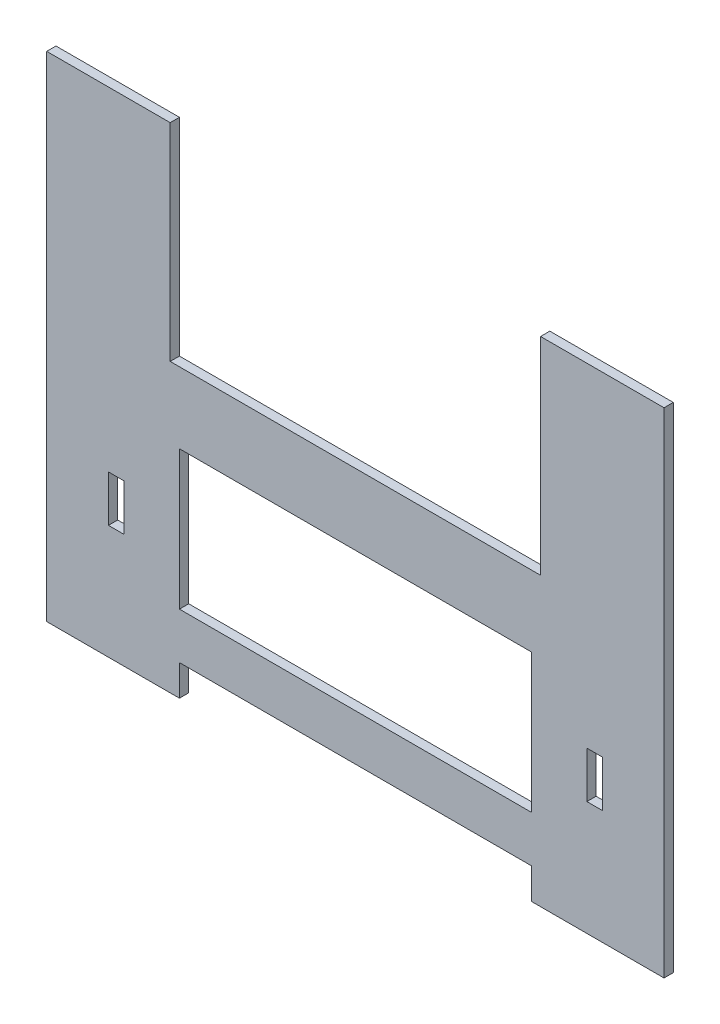
ISO-10303-21;
HEADER;
FILE_DESCRIPTION(('STEP AP214'),'2;1');
FILE_NAME('part.step','',(''),(''),'','','');
FILE_SCHEMA(('AUTOMOTIVE_DESIGN { 1 0 10303 214 1 1 1 1 }'));
ENDSEC;
DATA;
#1=APPLICATION_CONTEXT('core data for automotive mechanical design processes');
#2=APPLICATION_PROTOCOL_DEFINITION('international standard','automotive_design',2000,#1);
#3=PRODUCT_CONTEXT('',#1,'mechanical');
#4=PRODUCT('Part','Part','',(#3));
#5=PRODUCT_RELATED_PRODUCT_CATEGORY('part','',(#4));
#6=PRODUCT_DEFINITION_FORMATION('','',#4);
#7=PRODUCT_DEFINITION_CONTEXT('part definition',#1,'design');
#8=PRODUCT_DEFINITION('design','',#6,#7);
#9=PRODUCT_DEFINITION_SHAPE('','',#8);
#10=(LENGTH_UNIT() NAMED_UNIT(*) SI_UNIT(.MILLI.,.METRE.));
#11=(NAMED_UNIT(*) PLANE_ANGLE_UNIT() SI_UNIT($,.RADIAN.));
#12=(NAMED_UNIT(*) SI_UNIT($,.STERADIAN.) SOLID_ANGLE_UNIT());
#13=UNCERTAINTY_MEASURE_WITH_UNIT(LENGTH_MEASURE(1.E-05),#10,'distance_accuracy_value','');
#14=(GEOMETRIC_REPRESENTATION_CONTEXT(3) GLOBAL_UNCERTAINTY_ASSIGNED_CONTEXT((#13)) GLOBAL_UNIT_ASSIGNED_CONTEXT((#10,
#11,#12)) REPRESENTATION_CONTEXT('',''));
#15=CARTESIAN_POINT('',(0.,0.,0.));
#16=DIRECTION('',(0.,0.,1.));
#17=DIRECTION('',(1.,0.,0.));
#18=AXIS2_PLACEMENT_3D('',#15,#16,#17);
#19=CARTESIAN_POINT('',(0.,0.,3.));
#20=DIRECTION('',(0.,0.,-1.));
#21=DIRECTION('',(-1.,0.,0.));
#22=AXIS2_PLACEMENT_3D('',#19,#20,#21);
#23=PLANE('',#22);
#24=DIRECTION('',(1.,0.,0.));
#25=VECTOR('',#24,1.);
#26=CARTESIAN_POINT('',(-80.,-56.,3.));
#27=LINE('',#26,#25);
#28=CARTESIAN_POINT('',(-80.,-56.,3.));
#29=VERTEX_POINT('',#28);
#30=CARTESIAN_POINT('',(-75.,-56.,3.));
#31=VERTEX_POINT('',#30);
#32=EDGE_CURVE('E212',#29,#31,#27,.T.);
#33=ORIENTED_EDGE('',*,*,#32,.F.);
#34=DIRECTION('',(0.,-1.,0.));
#35=VECTOR('',#34,1.);
#36=CARTESIAN_POINT('',(-80.,-41.,3.));
#37=LINE('',#36,#35);
#38=CARTESIAN_POINT('',(-80.,-41.,3.));
#39=VERTEX_POINT('',#38);
#40=EDGE_CURVE('E50',#39,#29,#37,.T.);
#41=ORIENTED_EDGE('',*,*,#40,.F.);
#42=DIRECTION('',(-1.,0.,0.));
#43=VECTOR('',#42,1.);
#44=CARTESIAN_POINT('',(-80.,-41.,3.));
#45=LINE('',#44,#43);
#46=CARTESIAN_POINT('',(-75.,-41.,3.));
#47=VERTEX_POINT('',#46);
#48=EDGE_CURVE('E218',#47,#39,#45,.T.);
#49=ORIENTED_EDGE('',*,*,#48,.F.);
#50=DIRECTION('',(0.,1.,0.));
#51=VECTOR('',#50,1.);
#52=CARTESIAN_POINT('',(-75.,-41.,3.));
#53=LINE('',#52,#51);
#54=EDGE_CURVE('E202',#31,#47,#53,.T.);
#55=ORIENTED_EDGE('',*,*,#54,.F.);
#56=EDGE_LOOP('',(#33,#41,#49,#55));
#57=FACE_BOUND('',#56,.T.);
#58=DIRECTION('',(0.,-1.,0.));
#59=VECTOR('',#58,1.);
#60=CARTESIAN_POINT('',(75.,-41.,3.));
#61=LINE('',#60,#59);
#62=CARTESIAN_POINT('',(75.,-41.,3.));
#63=VERTEX_POINT('',#62);
#64=CARTESIAN_POINT('',(75.,-56.,3.));
#65=VERTEX_POINT('',#64);
#66=EDGE_CURVE('E229',#63,#65,#61,.T.);
#67=ORIENTED_EDGE('',*,*,#66,.F.);
#68=DIRECTION('',(-1.,0.,0.));
#69=VECTOR('',#68,1.);
#70=CARTESIAN_POINT('',(80.,-41.,3.));
#71=LINE('',#70,#69);
#72=CARTESIAN_POINT('',(80.,-41.,3.));
#73=VERTEX_POINT('',#72);
#74=EDGE_CURVE('E58',#73,#63,#71,.T.);
#75=ORIENTED_EDGE('',*,*,#74,.F.);
#76=DIRECTION('',(0.,1.,0.));
#77=VECTOR('',#76,1.);
#78=CARTESIAN_POINT('',(80.,-41.,3.));
#79=LINE('',#78,#77);
#80=CARTESIAN_POINT('',(80.,-56.,3.));
#81=VERTEX_POINT('',#80);
#82=EDGE_CURVE('E235',#81,#73,#79,.T.);
#83=ORIENTED_EDGE('',*,*,#82,.F.);
#84=DIRECTION('',(1.,0.,0.));
#85=VECTOR('',#84,1.);
#86=CARTESIAN_POINT('',(80.,-56.,3.));
#87=LINE('',#86,#85);
#88=EDGE_CURVE('E232',#65,#81,#87,.T.);
#89=ORIENTED_EDGE('',*,*,#88,.F.);
#90=EDGE_LOOP('',(#67,#75,#83,#89));
#91=FACE_BOUND('',#90,.T.);
#92=DIRECTION('',(0.,-1.,0.));
#93=VECTOR('',#92,1.);
#94=CARTESIAN_POINT('',(57.,-93.,3.));
#95=LINE('',#94,#93);
#96=CARTESIAN_POINT('',(57.,-83.,3.));
#97=VERTEX_POINT('',#96);
#98=CARTESIAN_POINT('',(57.,-93.,3.));
#99=VERTEX_POINT('',#98);
#100=EDGE_CURVE('E277',#97,#99,#95,.T.);
#101=ORIENTED_EDGE('',*,*,#100,.T.);
#102=DIRECTION('',(1.,0.,0.));
#103=VECTOR('',#102,1.);
#104=CARTESIAN_POINT('',(100.,-93.,3.));
#105=LINE('',#104,#103);
#106=CARTESIAN_POINT('',(100.,-93.,3.));
#107=VERTEX_POINT('',#106);
#108=EDGE_CURVE('E280',#99,#107,#105,.T.);
#109=ORIENTED_EDGE('',*,*,#108,.T.);
#110=DIRECTION('',(0.,1.,0.));
#111=VECTOR('',#110,1.);
#112=CARTESIAN_POINT('',(100.,67.,3.));
#113=LINE('',#112,#111);
#114=CARTESIAN_POINT('',(100.,67.,3.));
#115=VERTEX_POINT('',#114);
#116=EDGE_CURVE('E283',#107,#115,#113,.T.);
#117=ORIENTED_EDGE('',*,*,#116,.T.);
#118=DIRECTION('',(-1.,0.,0.));
#119=VECTOR('',#118,1.);
#120=CARTESIAN_POINT('',(60.,67.,3.));
#121=LINE('',#120,#119);
#122=CARTESIAN_POINT('',(60.,67.,3.));
#123=VERTEX_POINT('',#122);
#124=EDGE_CURVE('E285',#115,#123,#121,.T.);
#125=ORIENTED_EDGE('',*,*,#124,.T.);
#126=DIRECTION('',(0.,-1.,0.));
#127=VECTOR('',#126,1.);
#128=CARTESIAN_POINT('',(60.,67.,3.));
#129=LINE('',#128,#127);
#130=CARTESIAN_POINT('',(60.,0.,3.));
#131=VERTEX_POINT('',#130);
#132=EDGE_CURVE('E287',#123,#131,#129,.T.);
#133=ORIENTED_EDGE('',*,*,#132,.T.);
#134=DIRECTION('',(-1.,0.,0.));
#135=VECTOR('',#134,1.);
#136=CARTESIAN_POINT('',(60.,0.,3.));
#137=LINE('',#136,#135);
#138=CARTESIAN_POINT('',(-60.,0.,3.));
#139=VERTEX_POINT('',#138);
#140=EDGE_CURVE('E289',#131,#139,#137,.T.);
#141=ORIENTED_EDGE('',*,*,#140,.T.);
#142=DIRECTION('',(0.,1.,0.));
#143=VECTOR('',#142,1.);
#144=CARTESIAN_POINT('',(-60.,67.,3.));
#145=LINE('',#144,#143);
#146=CARTESIAN_POINT('',(-60.,67.,3.));
#147=VERTEX_POINT('',#146);
#148=EDGE_CURVE('E291',#139,#147,#145,.T.);
#149=ORIENTED_EDGE('',*,*,#148,.T.);
#150=DIRECTION('',(-1.,0.,0.));
#151=VECTOR('',#150,1.);
#152=CARTESIAN_POINT('',(-60.,67.,3.));
#153=LINE('',#152,#151);
#154=CARTESIAN_POINT('',(-100.,67.,3.));
#155=VERTEX_POINT('',#154);
#156=EDGE_CURVE('E293',#147,#155,#153,.T.);
#157=ORIENTED_EDGE('',*,*,#156,.T.);
#158=DIRECTION('',(0.,-1.,0.));
#159=VECTOR('',#158,1.);
#160=CARTESIAN_POINT('',(-100.,67.,3.));
#161=LINE('',#160,#159);
#162=CARTESIAN_POINT('',(-100.,-93.,3.));
#163=VERTEX_POINT('',#162);
#164=EDGE_CURVE('E295',#155,#163,#161,.T.);
#165=ORIENTED_EDGE('',*,*,#164,.T.);
#166=DIRECTION('',(1.,0.,0.));
#167=VECTOR('',#166,1.);
#168=CARTESIAN_POINT('',(-100.,-93.,3.));
#169=LINE('',#168,#167);
#170=CARTESIAN_POINT('',(-57.,-93.,3.));
#171=VERTEX_POINT('',#170);
#172=EDGE_CURVE('E297',#163,#171,#169,.T.);
#173=ORIENTED_EDGE('',*,*,#172,.T.);
#174=DIRECTION('',(0.,1.,0.));
#175=VECTOR('',#174,1.);
#176=CARTESIAN_POINT('',(-57.,-93.,3.));
#177=LINE('',#176,#175);
#178=CARTESIAN_POINT('',(-57.,-83.,3.));
#179=VERTEX_POINT('',#178);
#180=EDGE_CURVE('E299',#171,#179,#177,.T.);
#181=ORIENTED_EDGE('',*,*,#180,.T.);
#182=DIRECTION('',(1.,0.,0.));
#183=VECTOR('',#182,1.);
#184=CARTESIAN_POINT('',(-57.,-83.,3.));
#185=LINE('',#184,#183);
#186=EDGE_CURVE('E301',#179,#97,#185,.T.);
#187=ORIENTED_EDGE('',*,*,#186,.T.);
#188=EDGE_LOOP('',(#101,#109,#117,#125,#133,#141,#149,#157,#165,#173,#181,#187));
#189=FACE_BOUND('',#188,.T.);
#190=DIRECTION('',(1.,0.,0.));
#191=VECTOR('',#190,1.);
#192=CARTESIAN_POINT('',(-57.,-68.,3.));
#193=LINE('',#192,#191);
#194=CARTESIAN_POINT('',(-57.,-68.,3.));
#195=VERTEX_POINT('',#194);
#196=CARTESIAN_POINT('',(57.,-68.,3.));
#197=VERTEX_POINT('',#196);
#198=EDGE_CURVE('E246',#195,#197,#193,.T.);
#199=ORIENTED_EDGE('',*,*,#198,.F.);
#200=DIRECTION('',(0.,-1.,0.));
#201=VECTOR('',#200,1.);
#202=CARTESIAN_POINT('',(-57.,-68.,3.));
#203=LINE('',#202,#201);
#204=CARTESIAN_POINT('',(-57.,-23.,3.));
#205=VERTEX_POINT('',#204);
#206=EDGE_CURVE('E254',#205,#195,#203,.T.);
#207=ORIENTED_EDGE('',*,*,#206,.F.);
#208=DIRECTION('',(-1.,0.,0.));
#209=VECTOR('',#208,1.);
#210=CARTESIAN_POINT('',(57.,-23.,3.));
#211=LINE('',#210,#209);
#212=CARTESIAN_POINT('',(57.,-23.,3.));
#213=VERTEX_POINT('',#212);
#214=EDGE_CURVE('E251',#213,#205,#211,.T.);
#215=ORIENTED_EDGE('',*,*,#214,.F.);
#216=DIRECTION('',(0.,1.,0.));
#217=VECTOR('',#216,1.);
#218=CARTESIAN_POINT('',(57.,-68.,3.));
#219=LINE('',#218,#217);
#220=EDGE_CURVE('E248',#197,#213,#219,.T.);
#221=ORIENTED_EDGE('',*,*,#220,.F.);
#222=EDGE_LOOP('',(#199,#207,#215,#221));
#223=FACE_BOUND('',#222,.T.);
#224=ADVANCED_FACE('F35',(#57,#91,#189,#223),#23,.F.);
#225=CARTESIAN_POINT('',(0.,0.,0.));
#226=DIRECTION('',(0.,0.,-1.));
#227=DIRECTION('',(-1.,0.,0.));
#228=AXIS2_PLACEMENT_3D('',#225,#226,#227);
#229=PLANE('',#228);
#230=DIRECTION('',(0.,1.,0.));
#231=VECTOR('',#230,1.);
#232=CARTESIAN_POINT('',(-80.,0.,0.));
#233=LINE('',#232,#231);
#234=CARTESIAN_POINT('',(-80.,-56.,0.));
#235=VERTEX_POINT('',#234);
#236=CARTESIAN_POINT('',(-80.,-41.,0.));
#237=VERTEX_POINT('',#236);
#238=EDGE_CURVE('E11',#235,#237,#233,.T.);
#239=ORIENTED_EDGE('',*,*,#238,.F.);
#240=DIRECTION('',(-1.,0.,0.));
#241=VECTOR('',#240,1.);
#242=CARTESIAN_POINT('',(0.,-56.,0.));
#243=LINE('',#242,#241);
#244=CARTESIAN_POINT('',(-75.,-56.,0.));
#245=VERTEX_POINT('',#244);
#246=EDGE_CURVE('E371',#245,#235,#243,.T.);
#247=ORIENTED_EDGE('',*,*,#246,.F.);
#248=DIRECTION('',(0.,-1.,0.));
#249=VECTOR('',#248,1.);
#250=CARTESIAN_POINT('',(-75.,0.,0.));
#251=LINE('',#250,#249);
#252=CARTESIAN_POINT('',(-75.,-41.,0.));
#253=VERTEX_POINT('',#252);
#254=EDGE_CURVE('E205',#253,#245,#251,.T.);
#255=ORIENTED_EDGE('',*,*,#254,.F.);
#256=DIRECTION('',(1.,0.,0.));
#257=VECTOR('',#256,1.);
#258=CARTESIAN_POINT('',(0.,-41.,0.));
#259=LINE('',#258,#257);
#260=EDGE_CURVE('E43',#237,#253,#259,.T.);
#261=ORIENTED_EDGE('',*,*,#260,.F.);
#262=EDGE_LOOP('',(#239,#247,#255,#261));
#263=FACE_BOUND('',#262,.T.);
#264=DIRECTION('',(1.,0.,0.));
#265=VECTOR('',#264,1.);
#266=CARTESIAN_POINT('',(0.,-41.,0.));
#267=LINE('',#266,#265);
#268=CARTESIAN_POINT('',(75.,-41.,0.));
#269=VERTEX_POINT('',#268);
#270=CARTESIAN_POINT('',(80.,-41.,0.));
#271=VERTEX_POINT('',#270);
#272=EDGE_CURVE('E369',#269,#271,#267,.T.);
#273=ORIENTED_EDGE('',*,*,#272,.F.);
#274=DIRECTION('',(0.,1.,0.));
#275=VECTOR('',#274,1.);
#276=CARTESIAN_POINT('',(75.,0.,0.));
#277=LINE('',#276,#275);
#278=CARTESIAN_POINT('',(75.,-56.,0.));
#279=VERTEX_POINT('',#278);
#280=EDGE_CURVE('E362',#279,#269,#277,.T.);
#281=ORIENTED_EDGE('',*,*,#280,.F.);
#282=DIRECTION('',(-1.,0.,0.));
#283=VECTOR('',#282,1.);
#284=CARTESIAN_POINT('',(0.,-56.,0.));
#285=LINE('',#284,#283);
#286=CARTESIAN_POINT('',(80.,-56.,0.));
#287=VERTEX_POINT('',#286);
#288=EDGE_CURVE('E364',#287,#279,#285,.T.);
#289=ORIENTED_EDGE('',*,*,#288,.F.);
#290=DIRECTION('',(0.,-1.,0.));
#291=VECTOR('',#290,1.);
#292=CARTESIAN_POINT('',(80.,0.,0.));
#293=LINE('',#292,#291);
#294=EDGE_CURVE('E367',#271,#287,#293,.T.);
#295=ORIENTED_EDGE('',*,*,#294,.F.);
#296=EDGE_LOOP('',(#273,#281,#289,#295));
#297=FACE_BOUND('',#296,.T.);
#298=DIRECTION('',(0.,-1.,0.));
#299=VECTOR('',#298,1.);
#300=CARTESIAN_POINT('',(57.,-93.,0.));
#301=LINE('',#300,#299);
#302=CARTESIAN_POINT('',(57.,-83.,0.));
#303=VERTEX_POINT('',#302);
#304=CARTESIAN_POINT('',(57.,-93.,0.));
#305=VERTEX_POINT('',#304);
#306=EDGE_CURVE('E276',#303,#305,#301,.T.);
#307=ORIENTED_EDGE('',*,*,#306,.F.);
#308=DIRECTION('',(1.,0.,0.));
#309=VECTOR('',#308,1.);
#310=CARTESIAN_POINT('',(-57.,-83.,0.));
#311=LINE('',#310,#309);
#312=CARTESIAN_POINT('',(-57.,-83.,0.));
#313=VERTEX_POINT('',#312);
#314=EDGE_CURVE('E281',#313,#303,#311,.T.);
#315=ORIENTED_EDGE('',*,*,#314,.F.);
#316=DIRECTION('',(0.,1.,0.));
#317=VECTOR('',#316,1.);
#318=CARTESIAN_POINT('',(-57.,-93.,0.));
#319=LINE('',#318,#317);
#320=CARTESIAN_POINT('',(-57.,-93.,0.));
#321=VERTEX_POINT('',#320);
#322=EDGE_CURVE('E324',#321,#313,#319,.T.);
#323=ORIENTED_EDGE('',*,*,#322,.F.);
#324=DIRECTION('',(1.,0.,0.));
#325=VECTOR('',#324,1.);
#326=CARTESIAN_POINT('',(-100.,-93.,0.));
#327=LINE('',#326,#325);
#328=CARTESIAN_POINT('',(-100.,-93.,0.));
#329=VERTEX_POINT('',#328);
#330=EDGE_CURVE('E322',#329,#321,#327,.T.);
#331=ORIENTED_EDGE('',*,*,#330,.F.);
#332=DIRECTION('',(0.,-1.,0.));
#333=VECTOR('',#332,1.);
#334=CARTESIAN_POINT('',(-100.,67.,0.));
#335=LINE('',#334,#333);
#336=CARTESIAN_POINT('',(-100.,67.,0.));
#337=VERTEX_POINT('',#336);
#338=EDGE_CURVE('E320',#337,#329,#335,.T.);
#339=ORIENTED_EDGE('',*,*,#338,.F.);
#340=DIRECTION('',(-1.,0.,0.));
#341=VECTOR('',#340,1.);
#342=CARTESIAN_POINT('',(-60.,67.,0.));
#343=LINE('',#342,#341);
#344=CARTESIAN_POINT('',(-60.,67.,0.));
#345=VERTEX_POINT('',#344);
#346=EDGE_CURVE('E318',#345,#337,#343,.T.);
#347=ORIENTED_EDGE('',*,*,#346,.F.);
#348=DIRECTION('',(0.,1.,0.));
#349=VECTOR('',#348,1.);
#350=CARTESIAN_POINT('',(-60.,67.,0.));
#351=LINE('',#350,#349);
#352=CARTESIAN_POINT('',(-60.,0.,0.));
#353=VERTEX_POINT('',#352);
#354=EDGE_CURVE('E316',#353,#345,#351,.T.);
#355=ORIENTED_EDGE('',*,*,#354,.F.);
#356=DIRECTION('',(-1.,0.,0.));
#357=VECTOR('',#356,1.);
#358=CARTESIAN_POINT('',(60.,0.,0.));
#359=LINE('',#358,#357);
#360=CARTESIAN_POINT('',(60.,0.,0.));
#361=VERTEX_POINT('',#360);
#362=EDGE_CURVE('E314',#361,#353,#359,.T.);
#363=ORIENTED_EDGE('',*,*,#362,.F.);
#364=DIRECTION('',(0.,-1.,0.));
#365=VECTOR('',#364,1.);
#366=CARTESIAN_POINT('',(60.,67.,0.));
#367=LINE('',#366,#365);
#368=CARTESIAN_POINT('',(60.,67.,0.));
#369=VERTEX_POINT('',#368);
#370=EDGE_CURVE('E312',#369,#361,#367,.T.);
#371=ORIENTED_EDGE('',*,*,#370,.F.);
#372=DIRECTION('',(-1.,0.,0.));
#373=VECTOR('',#372,1.);
#374=CARTESIAN_POINT('',(60.,67.,0.));
#375=LINE('',#374,#373);
#376=CARTESIAN_POINT('',(100.,67.,0.));
#377=VERTEX_POINT('',#376);
#378=EDGE_CURVE('E310',#377,#369,#375,.T.);
#379=ORIENTED_EDGE('',*,*,#378,.F.);
#380=DIRECTION('',(0.,1.,0.));
#381=VECTOR('',#380,1.);
#382=CARTESIAN_POINT('',(100.,67.,0.));
#383=LINE('',#382,#381);
#384=CARTESIAN_POINT('',(100.,-93.,0.));
#385=VERTEX_POINT('',#384);
#386=EDGE_CURVE('E308',#385,#377,#383,.T.);
#387=ORIENTED_EDGE('',*,*,#386,.F.);
#388=DIRECTION('',(1.,0.,0.));
#389=VECTOR('',#388,1.);
#390=CARTESIAN_POINT('',(100.,-93.,0.));
#391=LINE('',#390,#389);
#392=EDGE_CURVE('E306',#305,#385,#391,.T.);
#393=ORIENTED_EDGE('',*,*,#392,.F.);
#394=EDGE_LOOP('',(#307,#315,#323,#331,#339,#347,#355,#363,#371,#379,#387,#393));
#395=FACE_BOUND('',#394,.T.);
#396=DIRECTION('',(0.,-1.,0.));
#397=VECTOR('',#396,1.);
#398=CARTESIAN_POINT('',(-57.,-68.,0.));
#399=LINE('',#398,#397);
#400=CARTESIAN_POINT('',(-57.,-23.,0.));
#401=VERTEX_POINT('',#400);
#402=CARTESIAN_POINT('',(-57.,-68.,0.));
#403=VERTEX_POINT('',#402);
#404=EDGE_CURVE('E249',#401,#403,#399,.T.);
#405=ORIENTED_EDGE('',*,*,#404,.T.);
#406=DIRECTION('',(1.,0.,0.));
#407=VECTOR('',#406,1.);
#408=CARTESIAN_POINT('',(-57.,-68.,0.));
#409=LINE('',#408,#407);
#410=CARTESIAN_POINT('',(57.,-68.,0.));
#411=VERTEX_POINT('',#410);
#412=EDGE_CURVE('E225',#403,#411,#409,.T.);
#413=ORIENTED_EDGE('',*,*,#412,.T.);
#414=DIRECTION('',(0.,1.,0.));
#415=VECTOR('',#414,1.);
#416=CARTESIAN_POINT('',(57.,-68.,0.));
#417=LINE('',#416,#415);
#418=CARTESIAN_POINT('',(57.,-23.,0.));
#419=VERTEX_POINT('',#418);
#420=EDGE_CURVE('E259',#411,#419,#417,.T.);
#421=ORIENTED_EDGE('',*,*,#420,.T.);
#422=DIRECTION('',(-1.,0.,0.));
#423=VECTOR('',#422,1.);
#424=CARTESIAN_POINT('',(57.,-23.,0.));
#425=LINE('',#424,#423);
#426=EDGE_CURVE('E262',#419,#401,#425,.T.);
#427=ORIENTED_EDGE('',*,*,#426,.T.);
#428=EDGE_LOOP('',(#405,#413,#421,#427));
#429=FACE_BOUND('',#428,.T.);
#430=ADVANCED_FACE('F379',(#263,#297,#395,#429),#229,.T.);
#431=CARTESIAN_POINT('',(57.,-93.,3.));
#432=DIRECTION('',(1.,0.,0.));
#433=DIRECTION('',(0.,1.,0.));
#434=AXIS2_PLACEMENT_3D('',#431,#432,#433);
#435=PLANE('',#434);
#436=ORIENTED_EDGE('',*,*,#306,.T.);
#437=DIRECTION('',(0.,0.,-1.));
#438=VECTOR('',#437,1.);
#439=CARTESIAN_POINT('',(57.,-93.,3.));
#440=LINE('',#439,#438);
#441=EDGE_CURVE('E359',#99,#305,#440,.T.);
#442=ORIENTED_EDGE('',*,*,#441,.F.);
#443=ORIENTED_EDGE('',*,*,#100,.F.);
#444=DIRECTION('',(0.,0.,-1.));
#445=VECTOR('',#444,1.);
#446=CARTESIAN_POINT('',(57.,-83.,3.));
#447=LINE('',#446,#445);
#448=EDGE_CURVE('E303',#97,#303,#447,.T.);
#449=ORIENTED_EDGE('',*,*,#448,.T.);
#450=EDGE_LOOP('',(#436,#442,#443,#449));
#451=FACE_BOUND('',#450,.T.);
#452=ADVANCED_FACE('F37',(#451),#435,.F.);
#453=CARTESIAN_POINT('',(100.,-93.,3.));
#454=DIRECTION('',(0.,1.,0.));
#455=DIRECTION('',(0.,0.,1.));
#456=AXIS2_PLACEMENT_3D('',#453,#454,#455);
#457=PLANE('',#456);
#458=ORIENTED_EDGE('',*,*,#392,.T.);
#459=DIRECTION('',(0.,0.,-1.));
#460=VECTOR('',#459,1.);
#461=CARTESIAN_POINT('',(100.,-93.,3.));
#462=LINE('',#461,#460);
#463=EDGE_CURVE('E356',#107,#385,#462,.T.);
#464=ORIENTED_EDGE('',*,*,#463,.F.);
#465=ORIENTED_EDGE('',*,*,#108,.F.);
#466=ORIENTED_EDGE('',*,*,#441,.T.);
#467=EDGE_LOOP('',(#458,#464,#465,#466));
#468=FACE_BOUND('',#467,.T.);
#469=ADVANCED_FACE('F443',(#468),#457,.F.);
#470=CARTESIAN_POINT('',(100.,67.,3.));
#471=DIRECTION('',(-1.,0.,0.));
#472=DIRECTION('',(0.,0.,1.));
#473=AXIS2_PLACEMENT_3D('',#470,#471,#472);
#474=PLANE('',#473);
#475=ORIENTED_EDGE('',*,*,#386,.T.);
#476=DIRECTION('',(0.,0.,-1.));
#477=VECTOR('',#476,1.);
#478=CARTESIAN_POINT('',(100.,67.,3.));
#479=LINE('',#478,#477);
#480=EDGE_CURVE('E353',#115,#377,#479,.T.);
#481=ORIENTED_EDGE('',*,*,#480,.F.);
#482=ORIENTED_EDGE('',*,*,#116,.F.);
#483=ORIENTED_EDGE('',*,*,#463,.T.);
#484=EDGE_LOOP('',(#475,#481,#482,#483));
#485=FACE_BOUND('',#484,.T.);
#486=ADVANCED_FACE('F440',(#485),#474,.F.);
#487=CARTESIAN_POINT('',(60.,67.,3.));
#488=DIRECTION('',(0.,-1.,0.));
#489=DIRECTION('',(0.,0.,-1.));
#490=AXIS2_PLACEMENT_3D('',#487,#488,#489);
#491=PLANE('',#490);
#492=ORIENTED_EDGE('',*,*,#378,.T.);
#493=DIRECTION('',(0.,0.,-1.));
#494=VECTOR('',#493,1.);
#495=CARTESIAN_POINT('',(60.,67.,3.));
#496=LINE('',#495,#494);
#497=EDGE_CURVE('E350',#123,#369,#496,.T.);
#498=ORIENTED_EDGE('',*,*,#497,.F.);
#499=ORIENTED_EDGE('',*,*,#124,.F.);
#500=ORIENTED_EDGE('',*,*,#480,.T.);
#501=EDGE_LOOP('',(#492,#498,#499,#500));
#502=FACE_BOUND('',#501,.T.);
#503=ADVANCED_FACE('F436',(#502),#491,.F.);
#504=CARTESIAN_POINT('',(60.,67.,3.));
#505=DIRECTION('',(1.,0.,0.));
#506=DIRECTION('',(0.,1.,0.));
#507=AXIS2_PLACEMENT_3D('',#504,#505,#506);
#508=PLANE('',#507);
#509=ORIENTED_EDGE('',*,*,#370,.T.);
#510=DIRECTION('',(0.,0.,-1.));
#511=VECTOR('',#510,1.);
#512=CARTESIAN_POINT('',(60.,0.,3.));
#513=LINE('',#512,#511);
#514=EDGE_CURVE('E347',#131,#361,#513,.T.);
#515=ORIENTED_EDGE('',*,*,#514,.F.);
#516=ORIENTED_EDGE('',*,*,#132,.F.);
#517=ORIENTED_EDGE('',*,*,#497,.T.);
#518=EDGE_LOOP('',(#509,#515,#516,#517));
#519=FACE_BOUND('',#518,.T.);
#520=ADVANCED_FACE('F432',(#519),#508,.F.);
#521=CARTESIAN_POINT('',(60.,0.,3.));
#522=DIRECTION('',(0.,-1.,0.));
#523=DIRECTION('',(0.,0.,-1.));
#524=AXIS2_PLACEMENT_3D('',#521,#522,#523);
#525=PLANE('',#524);
#526=ORIENTED_EDGE('',*,*,#362,.T.);
#527=DIRECTION('',(0.,0.,-1.));
#528=VECTOR('',#527,1.);
#529=CARTESIAN_POINT('',(-60.,0.,3.));
#530=LINE('',#529,#528);
#531=EDGE_CURVE('E344',#139,#353,#530,.T.);
#532=ORIENTED_EDGE('',*,*,#531,.F.);
#533=ORIENTED_EDGE('',*,*,#140,.F.);
#534=ORIENTED_EDGE('',*,*,#514,.T.);
#535=EDGE_LOOP('',(#526,#532,#533,#534));
#536=FACE_BOUND('',#535,.T.);
#537=ADVANCED_FACE('F428',(#536),#525,.F.);
#538=CARTESIAN_POINT('',(-60.,67.,3.));
#539=DIRECTION('',(-1.,0.,0.));
#540=DIRECTION('',(0.,-1.,0.));
#541=AXIS2_PLACEMENT_3D('',#538,#539,#540);
#542=PLANE('',#541);
#543=ORIENTED_EDGE('',*,*,#354,.T.);
#544=DIRECTION('',(0.,0.,-1.));
#545=VECTOR('',#544,1.);
#546=CARTESIAN_POINT('',(-60.,67.,3.));
#547=LINE('',#546,#545);
#548=EDGE_CURVE('E341',#147,#345,#547,.T.);
#549=ORIENTED_EDGE('',*,*,#548,.F.);
#550=ORIENTED_EDGE('',*,*,#148,.F.);
#551=ORIENTED_EDGE('',*,*,#531,.T.);
#552=EDGE_LOOP('',(#543,#549,#550,#551));
#553=FACE_BOUND('',#552,.T.);
#554=ADVANCED_FACE('F424',(#553),#542,.F.);
#555=CARTESIAN_POINT('',(-60.,67.,3.));
#556=DIRECTION('',(0.,-1.,0.));
#557=DIRECTION('',(0.,0.,-1.));
#558=AXIS2_PLACEMENT_3D('',#555,#556,#557);
#559=PLANE('',#558);
#560=ORIENTED_EDGE('',*,*,#346,.T.);
#561=DIRECTION('',(0.,0.,-1.));
#562=VECTOR('',#561,1.);
#563=CARTESIAN_POINT('',(-100.,67.,3.));
#564=LINE('',#563,#562);
#565=EDGE_CURVE('E338',#155,#337,#564,.T.);
#566=ORIENTED_EDGE('',*,*,#565,.F.);
#567=ORIENTED_EDGE('',*,*,#156,.F.);
#568=ORIENTED_EDGE('',*,*,#548,.T.);
#569=EDGE_LOOP('',(#560,#566,#567,#568));
#570=FACE_BOUND('',#569,.T.);
#571=ADVANCED_FACE('F420',(#570),#559,.F.);
#572=CARTESIAN_POINT('',(-100.,67.,3.));
#573=DIRECTION('',(1.,0.,0.));
#574=DIRECTION('',(0.,0.,-1.));
#575=AXIS2_PLACEMENT_3D('',#572,#573,#574);
#576=PLANE('',#575);
#577=ORIENTED_EDGE('',*,*,#338,.T.);
#578=DIRECTION('',(0.,0.,-1.));
#579=VECTOR('',#578,1.);
#580=CARTESIAN_POINT('',(-100.,-93.,3.));
#581=LINE('',#580,#579);
#582=EDGE_CURVE('E335',#163,#329,#581,.T.);
#583=ORIENTED_EDGE('',*,*,#582,.F.);
#584=ORIENTED_EDGE('',*,*,#164,.F.);
#585=ORIENTED_EDGE('',*,*,#565,.T.);
#586=EDGE_LOOP('',(#577,#583,#584,#585));
#587=FACE_BOUND('',#586,.T.);
#588=ADVANCED_FACE('F416',(#587),#576,.F.);
#589=CARTESIAN_POINT('',(-100.,-93.,3.));
#590=DIRECTION('',(0.,1.,0.));
#591=DIRECTION('',(0.,0.,1.));
#592=AXIS2_PLACEMENT_3D('',#589,#590,#591);
#593=PLANE('',#592);
#594=ORIENTED_EDGE('',*,*,#330,.T.);
#595=DIRECTION('',(0.,0.,-1.));
#596=VECTOR('',#595,1.);
#597=CARTESIAN_POINT('',(-57.,-93.,3.));
#598=LINE('',#597,#596);
#599=EDGE_CURVE('E332',#171,#321,#598,.T.);
#600=ORIENTED_EDGE('',*,*,#599,.F.);
#601=ORIENTED_EDGE('',*,*,#172,.F.);
#602=ORIENTED_EDGE('',*,*,#582,.T.);
#603=EDGE_LOOP('',(#594,#600,#601,#602));
#604=FACE_BOUND('',#603,.T.);
#605=ADVANCED_FACE('F412',(#604),#593,.F.);
#606=CARTESIAN_POINT('',(-57.,-93.,3.));
#607=DIRECTION('',(-1.,0.,0.));
#608=DIRECTION('',(0.,-1.,0.));
#609=AXIS2_PLACEMENT_3D('',#606,#607,#608);
#610=PLANE('',#609);
#611=ORIENTED_EDGE('',*,*,#322,.T.);
#612=DIRECTION('',(0.,0.,-1.));
#613=VECTOR('',#612,1.);
#614=CARTESIAN_POINT('',(-57.,-83.,3.));
#615=LINE('',#614,#613);
#616=EDGE_CURVE('E329',#179,#313,#615,.T.);
#617=ORIENTED_EDGE('',*,*,#616,.F.);
#618=ORIENTED_EDGE('',*,*,#180,.F.);
#619=ORIENTED_EDGE('',*,*,#599,.T.);
#620=EDGE_LOOP('',(#611,#617,#618,#619));
#621=FACE_BOUND('',#620,.T.);
#622=ADVANCED_FACE('F408',(#621),#610,.F.);
#623=CARTESIAN_POINT('',(-57.,-83.,3.));
#624=DIRECTION('',(0.,1.,0.));
#625=DIRECTION('',(0.,0.,1.));
#626=AXIS2_PLACEMENT_3D('',#623,#624,#625);
#627=PLANE('',#626);
#628=ORIENTED_EDGE('',*,*,#314,.T.);
#629=ORIENTED_EDGE('',*,*,#448,.F.);
#630=ORIENTED_EDGE('',*,*,#186,.F.);
#631=ORIENTED_EDGE('',*,*,#616,.T.);
#632=EDGE_LOOP('',(#628,#629,#630,#631));
#633=FACE_BOUND('',#632,.T.);
#634=ADVANCED_FACE('F405',(#633),#627,.F.);
#635=CARTESIAN_POINT('',(-57.,-68.,3.));
#636=DIRECTION('',(0.,1.,0.));
#637=DIRECTION('',(0.,0.,1.));
#638=AXIS2_PLACEMENT_3D('',#635,#636,#637);
#639=PLANE('',#638);
#640=ORIENTED_EDGE('',*,*,#412,.F.);
#641=DIRECTION('',(0.,0.,-1.));
#642=VECTOR('',#641,1.);
#643=CARTESIAN_POINT('',(-57.,-68.,3.));
#644=LINE('',#643,#642);
#645=EDGE_CURVE('E256',#195,#403,#644,.T.);
#646=ORIENTED_EDGE('',*,*,#645,.F.);
#647=ORIENTED_EDGE('',*,*,#198,.T.);
#648=DIRECTION('',(0.,0.,-1.));
#649=VECTOR('',#648,1.);
#650=CARTESIAN_POINT('',(57.,-68.,3.));
#651=LINE('',#650,#649);
#652=EDGE_CURVE('E273',#197,#411,#651,.T.);
#653=ORIENTED_EDGE('',*,*,#652,.T.);
#654=EDGE_LOOP('',(#640,#646,#647,#653));
#655=FACE_BOUND('',#654,.T.);
#656=ADVANCED_FACE('F402',(#655),#639,.T.);
#657=CARTESIAN_POINT('',(57.,-68.,3.));
#658=DIRECTION('',(-1.,0.,0.));
#659=DIRECTION('',(0.,-1.,0.));
#660=AXIS2_PLACEMENT_3D('',#657,#658,#659);
#661=PLANE('',#660);
#662=ORIENTED_EDGE('',*,*,#420,.F.);
#663=ORIENTED_EDGE('',*,*,#652,.F.);
#664=ORIENTED_EDGE('',*,*,#220,.T.);
#665=DIRECTION('',(0.,0.,-1.));
#666=VECTOR('',#665,1.);
#667=CARTESIAN_POINT('',(57.,-23.,3.));
#668=LINE('',#667,#666);
#669=EDGE_CURVE('E271',#213,#419,#668,.T.);
#670=ORIENTED_EDGE('',*,*,#669,.T.);
#671=EDGE_LOOP('',(#662,#663,#664,#670));
#672=FACE_BOUND('',#671,.T.);
#673=ADVANCED_FACE('F497',(#672),#661,.T.);
#674=CARTESIAN_POINT('',(57.,-23.,3.));
#675=DIRECTION('',(0.,-1.,0.));
#676=DIRECTION('',(0.,0.,-1.));
#677=AXIS2_PLACEMENT_3D('',#674,#675,#676);
#678=PLANE('',#677);
#679=ORIENTED_EDGE('',*,*,#426,.F.);
#680=ORIENTED_EDGE('',*,*,#669,.F.);
#681=ORIENTED_EDGE('',*,*,#214,.T.);
#682=DIRECTION('',(0.,0.,-1.));
#683=VECTOR('',#682,1.);
#684=CARTESIAN_POINT('',(-57.,-23.,3.));
#685=LINE('',#684,#683);
#686=EDGE_CURVE('E269',#205,#401,#685,.T.);
#687=ORIENTED_EDGE('',*,*,#686,.T.);
#688=EDGE_LOOP('',(#679,#680,#681,#687));
#689=FACE_BOUND('',#688,.T.);
#690=ADVANCED_FACE('F504',(#689),#678,.T.);
#691=CARTESIAN_POINT('',(-57.,-68.,3.));
#692=DIRECTION('',(1.,0.,0.));
#693=DIRECTION('',(0.,1.,0.));
#694=AXIS2_PLACEMENT_3D('',#691,#692,#693);
#695=PLANE('',#694);
#696=ORIENTED_EDGE('',*,*,#404,.F.);
#697=ORIENTED_EDGE('',*,*,#686,.F.);
#698=ORIENTED_EDGE('',*,*,#206,.T.);
#699=ORIENTED_EDGE('',*,*,#645,.T.);
#700=EDGE_LOOP('',(#696,#697,#698,#699));
#701=FACE_BOUND('',#700,.T.);
#702=ADVANCED_FACE('F502',(#701),#695,.T.);
#703=CARTESIAN_POINT('',(80.,-41.,-7.));
#704=DIRECTION('',(0.,1.,0.));
#705=DIRECTION('',(0.,0.,1.));
#706=AXIS2_PLACEMENT_3D('',#703,#704,#705);
#707=PLANE('',#706);
#708=ORIENTED_EDGE('',*,*,#272,.T.);
#709=DIRECTION('',(0.,0.,1.));
#710=VECTOR('',#709,1.);
#711=CARTESIAN_POINT('',(80.,-41.,-7.));
#712=LINE('',#711,#710);
#713=EDGE_CURVE('E239',#271,#73,#712,.T.);
#714=ORIENTED_EDGE('',*,*,#713,.T.);
#715=ORIENTED_EDGE('',*,*,#74,.T.);
#716=DIRECTION('',(0.,0.,1.));
#717=VECTOR('',#716,1.);
#718=CARTESIAN_POINT('',(75.,-41.,-7.));
#719=LINE('',#718,#717);
#720=EDGE_CURVE('E238',#269,#63,#719,.T.);
#721=ORIENTED_EDGE('',*,*,#720,.F.);
#722=EDGE_LOOP('',(#708,#714,#715,#721));
#723=FACE_BOUND('',#722,.T.);
#724=ADVANCED_FACE('F511',(#723),#707,.F.);
#725=CARTESIAN_POINT('',(80.,-41.,-7.));
#726=DIRECTION('',(1.,0.,0.));
#727=DIRECTION('',(0.,0.,-1.));
#728=AXIS2_PLACEMENT_3D('',#725,#726,#727);
#729=PLANE('',#728);
#730=ORIENTED_EDGE('',*,*,#294,.T.);
#731=DIRECTION('',(0.,0.,1.));
#732=VECTOR('',#731,1.);
#733=CARTESIAN_POINT('',(80.,-56.,-7.));
#734=LINE('',#733,#732);
#735=EDGE_CURVE('E241',#287,#81,#734,.T.);
#736=ORIENTED_EDGE('',*,*,#735,.T.);
#737=ORIENTED_EDGE('',*,*,#82,.T.);
#738=ORIENTED_EDGE('',*,*,#713,.F.);
#739=EDGE_LOOP('',(#730,#736,#737,#738));
#740=FACE_BOUND('',#739,.T.);
#741=ADVANCED_FACE('F515',(#740),#729,.F.);
#742=CARTESIAN_POINT('',(80.,-56.,-7.));
#743=DIRECTION('',(0.,-1.,0.));
#744=DIRECTION('',(0.,0.,-1.));
#745=AXIS2_PLACEMENT_3D('',#742,#743,#744);
#746=PLANE('',#745);
#747=ORIENTED_EDGE('',*,*,#288,.T.);
#748=DIRECTION('',(0.,0.,1.));
#749=VECTOR('',#748,1.);
#750=CARTESIAN_POINT('',(75.,-56.,-7.));
#751=LINE('',#750,#749);
#752=EDGE_CURVE('E243',#279,#65,#751,.T.);
#753=ORIENTED_EDGE('',*,*,#752,.T.);
#754=ORIENTED_EDGE('',*,*,#88,.T.);
#755=ORIENTED_EDGE('',*,*,#735,.F.);
#756=EDGE_LOOP('',(#747,#753,#754,#755));
#757=FACE_BOUND('',#756,.T.);
#758=ADVANCED_FACE('F390',(#757),#746,.F.);
#759=CARTESIAN_POINT('',(75.,-41.,-7.));
#760=DIRECTION('',(-1.,0.,0.));
#761=DIRECTION('',(0.,-1.,0.));
#762=AXIS2_PLACEMENT_3D('',#759,#760,#761);
#763=PLANE('',#762);
#764=ORIENTED_EDGE('',*,*,#280,.T.);
#765=ORIENTED_EDGE('',*,*,#720,.T.);
#766=ORIENTED_EDGE('',*,*,#66,.T.);
#767=ORIENTED_EDGE('',*,*,#752,.F.);
#768=EDGE_LOOP('',(#764,#765,#766,#767));
#769=FACE_BOUND('',#768,.T.);
#770=ADVANCED_FACE('F383',(#769),#763,.F.);
#771=CARTESIAN_POINT('',(-80.,-41.,-7.));
#772=DIRECTION('',(-1.,0.,0.));
#773=DIRECTION('',(0.,0.,1.));
#774=AXIS2_PLACEMENT_3D('',#771,#772,#773);
#775=PLANE('',#774);
#776=ORIENTED_EDGE('',*,*,#238,.T.);
#777=DIRECTION('',(0.,0.,1.));
#778=VECTOR('',#777,1.);
#779=CARTESIAN_POINT('',(-80.,-41.,-7.));
#780=LINE('',#779,#778);
#781=EDGE_CURVE('E223',#237,#39,#780,.T.);
#782=ORIENTED_EDGE('',*,*,#781,.T.);
#783=ORIENTED_EDGE('',*,*,#40,.T.);
#784=DIRECTION('',(0.,0.,1.));
#785=VECTOR('',#784,1.);
#786=CARTESIAN_POINT('',(-80.,-56.,-7.));
#787=LINE('',#786,#785);
#788=EDGE_CURVE('E209',#235,#29,#787,.T.);
#789=ORIENTED_EDGE('',*,*,#788,.F.);
#790=EDGE_LOOP('',(#776,#782,#783,#789));
#791=FACE_BOUND('',#790,.T.);
#792=ADVANCED_FACE('F381',(#791),#775,.F.);
#793=CARTESIAN_POINT('',(-80.,-41.,-7.));
#794=DIRECTION('',(0.,1.,0.));
#795=DIRECTION('',(0.,0.,1.));
#796=AXIS2_PLACEMENT_3D('',#793,#794,#795);
#797=PLANE('',#796);
#798=ORIENTED_EDGE('',*,*,#260,.T.);
#799=DIRECTION('',(0.,0.,1.));
#800=VECTOR('',#799,1.);
#801=CARTESIAN_POINT('',(-75.,-41.,-7.));
#802=LINE('',#801,#800);
#803=EDGE_CURVE('E208',#253,#47,#802,.T.);
#804=ORIENTED_EDGE('',*,*,#803,.T.);
#805=ORIENTED_EDGE('',*,*,#48,.T.);
#806=ORIENTED_EDGE('',*,*,#781,.F.);
#807=EDGE_LOOP('',(#798,#804,#805,#806));
#808=FACE_BOUND('',#807,.T.);
#809=ADVANCED_FACE('F376',(#808),#797,.F.);
#810=CARTESIAN_POINT('',(-75.,-41.,-7.));
#811=DIRECTION('',(1.,0.,0.));
#812=DIRECTION('',(0.,1.,0.));
#813=AXIS2_PLACEMENT_3D('',#810,#811,#812);
#814=PLANE('',#813);
#815=ORIENTED_EDGE('',*,*,#254,.T.);
#816=DIRECTION('',(0.,0.,1.));
#817=VECTOR('',#816,1.);
#818=CARTESIAN_POINT('',(-75.,-56.,-7.));
#819=LINE('',#818,#817);
#820=EDGE_CURVE('E197',#245,#31,#819,.T.);
#821=ORIENTED_EDGE('',*,*,#820,.T.);
#822=ORIENTED_EDGE('',*,*,#54,.T.);
#823=ORIENTED_EDGE('',*,*,#803,.F.);
#824=EDGE_LOOP('',(#815,#821,#822,#823));
#825=FACE_BOUND('',#824,.T.);
#826=ADVANCED_FACE('F199',(#825),#814,.F.);
#827=CARTESIAN_POINT('',(-80.,-56.,-7.));
#828=DIRECTION('',(0.,-1.,0.));
#829=DIRECTION('',(0.,0.,-1.));
#830=AXIS2_PLACEMENT_3D('',#827,#828,#829);
#831=PLANE('',#830);
#832=ORIENTED_EDGE('',*,*,#246,.T.);
#833=ORIENTED_EDGE('',*,*,#788,.T.);
#834=ORIENTED_EDGE('',*,*,#32,.T.);
#835=ORIENTED_EDGE('',*,*,#820,.F.);
#836=EDGE_LOOP('',(#832,#833,#834,#835));
#837=FACE_BOUND('',#836,.T.);
#838=ADVANCED_FACE('F213',(#837),#831,.F.);
#839=CLOSED_SHELL('',(#224,#430,#452,#469,#486,#503,#520,#537,#554,#571,#588,#605,#622,#634,
#656,#673,#690,#702,#724,#741,#758,#770,#792,#809,#826,#838));
#840=MANIFOLD_SOLID_BREP('B2',#839);
#841=ADVANCED_BREP_SHAPE_REPRESENTATION('',(#18,#840),#14);
#842=SHAPE_DEFINITION_REPRESENTATION(#9,#841);
ENDSEC;
END-ISO-10303-21;
